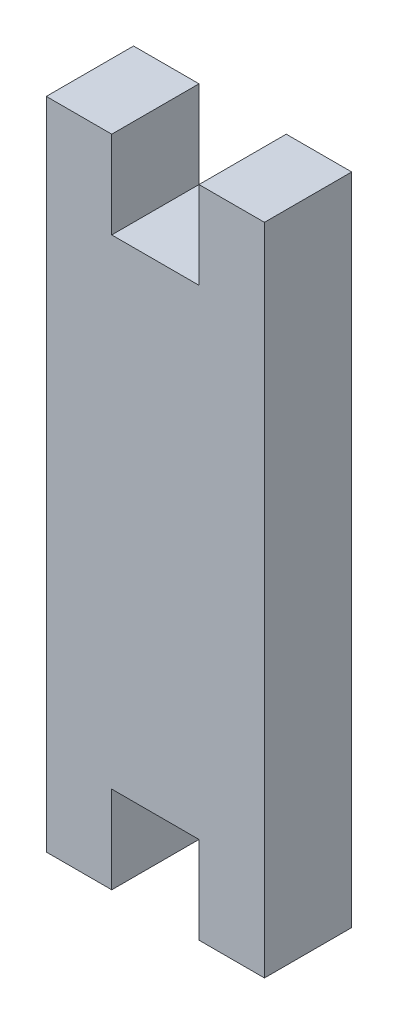
ISO-10303-21;
HEADER;
FILE_DESCRIPTION(('STEP AP214'),'2;1');
FILE_NAME('part.step','',(''),(''),'','','');
FILE_SCHEMA(('AUTOMOTIVE_DESIGN { 1 0 10303 214 1 1 1 1 }'));
ENDSEC;
DATA;
#1=APPLICATION_CONTEXT('core data for automotive mechanical design processes');
#2=APPLICATION_PROTOCOL_DEFINITION('international standard','automotive_design',2000,#1);
#3=PRODUCT_CONTEXT('',#1,'mechanical');
#4=PRODUCT('Part','Part','',(#3));
#5=PRODUCT_RELATED_PRODUCT_CATEGORY('part','',(#4));
#6=PRODUCT_DEFINITION_FORMATION('','',#4);
#7=PRODUCT_DEFINITION_CONTEXT('part definition',#1,'design');
#8=PRODUCT_DEFINITION('design','',#6,#7);
#9=PRODUCT_DEFINITION_SHAPE('','',#8);
#10=(LENGTH_UNIT() NAMED_UNIT(*) SI_UNIT(.MILLI.,.METRE.));
#11=(NAMED_UNIT(*) PLANE_ANGLE_UNIT() SI_UNIT($,.RADIAN.));
#12=(NAMED_UNIT(*) SI_UNIT($,.STERADIAN.) SOLID_ANGLE_UNIT());
#13=UNCERTAINTY_MEASURE_WITH_UNIT(LENGTH_MEASURE(1.E-05),#10,'distance_accuracy_value','');
#14=(GEOMETRIC_REPRESENTATION_CONTEXT(3) GLOBAL_UNCERTAINTY_ASSIGNED_CONTEXT((#13)) GLOBAL_UNIT_ASSIGNED_CONTEXT((#10,
#11,#12)) REPRESENTATION_CONTEXT('',''));
#15=CARTESIAN_POINT('',(0.,0.,0.));
#16=DIRECTION('',(0.,0.,1.));
#17=DIRECTION('',(1.,0.,0.));
#18=AXIS2_PLACEMENT_3D('',#15,#16,#17);
#19=CARTESIAN_POINT('',(0.,30.,4.));
#20=DIRECTION('',(0.,-1.,0.));
#21=DIRECTION('',(0.,0.,-1.));
#22=AXIS2_PLACEMENT_3D('',#19,#20,#21);
#23=PLANE('',#22);
#24=DIRECTION('',(-1.,0.,0.));
#25=VECTOR('',#24,1.);
#26=CARTESIAN_POINT('',(0.,30.,4.));
#27=LINE('',#26,#25);
#28=CARTESIAN_POINT('',(3.,30.,4.));
#29=VERTEX_POINT('',#28);
#30=CARTESIAN_POINT('',(0.,30.,4.));
#31=VERTEX_POINT('',#30);
#32=EDGE_CURVE('E185',#29,#31,#27,.T.);
#33=ORIENTED_EDGE('',*,*,#32,.F.);
#34=DIRECTION('',(0.,0.,-1.));
#35=VECTOR('',#34,1.);
#36=CARTESIAN_POINT('',(3.,30.,4.));
#37=LINE('',#36,#35);
#38=CARTESIAN_POINT('',(3.,30.,0.));
#39=VERTEX_POINT('',#38);
#40=EDGE_CURVE('E150',#29,#39,#37,.T.);
#41=ORIENTED_EDGE('',*,*,#40,.T.);
#42=DIRECTION('',(-1.,0.,0.));
#43=VECTOR('',#42,1.);
#44=CARTESIAN_POINT('',(0.,30.,0.));
#45=LINE('',#44,#43);
#46=CARTESIAN_POINT('',(0.,30.,0.));
#47=VERTEX_POINT('',#46);
#48=EDGE_CURVE('E196',#39,#47,#45,.T.);
#49=ORIENTED_EDGE('',*,*,#48,.T.);
#50=DIRECTION('',(0.,0.,-1.));
#51=VECTOR('',#50,1.);
#52=CARTESIAN_POINT('',(0.,30.,4.));
#53=LINE('',#52,#51);
#54=EDGE_CURVE('E187',#31,#47,#53,.T.);
#55=ORIENTED_EDGE('',*,*,#54,.F.);
#56=EDGE_LOOP('',(#33,#41,#49,#55));
#57=FACE_BOUND('',#56,.T.);
#58=ADVANCED_FACE('F32',(#57),#23,.F.);
#59=CARTESIAN_POINT('',(0.,0.,4.));
#60=DIRECTION('',(0.,1.,0.));
#61=DIRECTION('',(0.,0.,1.));
#62=AXIS2_PLACEMENT_3D('',#59,#60,#61);
#63=PLANE('',#62);
#64=DIRECTION('',(1.,0.,0.));
#65=VECTOR('',#64,1.);
#66=CARTESIAN_POINT('',(0.,0.,0.));
#67=LINE('',#66,#65);
#68=CARTESIAN_POINT('',(0.,0.,0.));
#69=VERTEX_POINT('',#68);
#70=CARTESIAN_POINT('',(3.,0.,0.));
#71=VERTEX_POINT('',#70);
#72=EDGE_CURVE('E191',#69,#71,#67,.T.);
#73=ORIENTED_EDGE('',*,*,#72,.T.);
#74=DIRECTION('',(0.,0.,1.));
#75=VECTOR('',#74,1.);
#76=CARTESIAN_POINT('',(3.,0.,4.));
#77=LINE('',#76,#75);
#78=CARTESIAN_POINT('',(3.,0.,4.));
#79=VERTEX_POINT('',#78);
#80=EDGE_CURVE('E171',#71,#79,#77,.T.);
#81=ORIENTED_EDGE('',*,*,#80,.T.);
#82=DIRECTION('',(1.,0.,0.));
#83=VECTOR('',#82,1.);
#84=CARTESIAN_POINT('',(0.,0.,4.));
#85=LINE('',#84,#83);
#86=CARTESIAN_POINT('',(0.,0.,4.));
#87=VERTEX_POINT('',#86);
#88=EDGE_CURVE('E180',#87,#79,#85,.T.);
#89=ORIENTED_EDGE('',*,*,#88,.F.);
#90=DIRECTION('',(0.,0.,-1.));
#91=VECTOR('',#90,1.);
#92=CARTESIAN_POINT('',(0.,0.,4.));
#93=LINE('',#92,#91);
#94=EDGE_CURVE('E207',#87,#69,#93,.T.);
#95=ORIENTED_EDGE('',*,*,#94,.T.);
#96=EDGE_LOOP('',(#73,#81,#89,#95));
#97=FACE_BOUND('',#96,.T.);
#98=ADVANCED_FACE('F239',(#97),#63,.F.);
#99=CARTESIAN_POINT('',(0.,0.,4.));
#100=DIRECTION('',(1.,0.,0.));
#101=DIRECTION('',(0.,0.,-1.));
#102=AXIS2_PLACEMENT_3D('',#99,#100,#101);
#103=PLANE('',#102);
#104=DIRECTION('',(0.,-1.,0.));
#105=VECTOR('',#104,1.);
#106=CARTESIAN_POINT('',(0.,0.,0.));
#107=LINE('',#106,#105);
#108=EDGE_CURVE('E174',#47,#69,#107,.T.);
#109=ORIENTED_EDGE('',*,*,#108,.T.);
#110=ORIENTED_EDGE('',*,*,#94,.F.);
#111=DIRECTION('',(0.,-1.,0.));
#112=VECTOR('',#111,1.);
#113=CARTESIAN_POINT('',(0.,0.,4.));
#114=LINE('',#113,#112);
#115=EDGE_CURVE('E175',#31,#87,#114,.T.);
#116=ORIENTED_EDGE('',*,*,#115,.F.);
#117=ORIENTED_EDGE('',*,*,#54,.T.);
#118=EDGE_LOOP('',(#109,#110,#116,#117));
#119=FACE_BOUND('',#118,.T.);
#120=ADVANCED_FACE('F34',(#119),#103,.F.);
#121=CARTESIAN_POINT('',(7.,0.,4.));
#122=VERTEX_POINT('',#121);
#123=CARTESIAN_POINT('',(10.,0.,4.));
#124=VERTEX_POINT('',#123);
#125=EDGE_CURVE('E178',#122,#124,#85,.T.);
#126=ORIENTED_EDGE('',*,*,#125,.F.);
#127=DIRECTION('',(0.,0.,-1.));
#128=VECTOR('',#127,1.);
#129=CARTESIAN_POINT('',(7.,0.,4.));
#130=LINE('',#129,#128);
#131=CARTESIAN_POINT('',(7.,0.,0.));
#132=VERTEX_POINT('',#131);
#133=EDGE_CURVE('E167',#122,#132,#130,.T.);
#134=ORIENTED_EDGE('',*,*,#133,.T.);
#135=CARTESIAN_POINT('',(10.,0.,0.));
#136=VERTEX_POINT('',#135);
#137=EDGE_CURVE('E190',#132,#136,#67,.T.);
#138=ORIENTED_EDGE('',*,*,#137,.T.);
#139=DIRECTION('',(0.,0.,-1.));
#140=VECTOR('',#139,1.);
#141=CARTESIAN_POINT('',(10.,0.,4.));
#142=LINE('',#141,#140);
#143=EDGE_CURVE('E204',#124,#136,#142,.T.);
#144=ORIENTED_EDGE('',*,*,#143,.F.);
#145=EDGE_LOOP('',(#126,#134,#138,#144));
#146=FACE_BOUND('',#145,.T.);
#147=ADVANCED_FACE('F217',(#146),#63,.F.);
#148=CARTESIAN_POINT('',(10.,0.,4.));
#149=DIRECTION('',(-1.,0.,0.));
#150=DIRECTION('',(0.,0.,1.));
#151=AXIS2_PLACEMENT_3D('',#148,#149,#150);
#152=PLANE('',#151);
#153=DIRECTION('',(0.,1.,0.));
#154=VECTOR('',#153,1.);
#155=CARTESIAN_POINT('',(10.,0.,0.));
#156=LINE('',#155,#154);
#157=CARTESIAN_POINT('',(10.,30.,0.));
#158=VERTEX_POINT('',#157);
#159=EDGE_CURVE('E194',#136,#158,#156,.T.);
#160=ORIENTED_EDGE('',*,*,#159,.T.);
#161=DIRECTION('',(0.,0.,-1.));
#162=VECTOR('',#161,1.);
#163=CARTESIAN_POINT('',(10.,30.,4.));
#164=LINE('',#163,#162);
#165=CARTESIAN_POINT('',(10.,30.,4.));
#166=VERTEX_POINT('',#165);
#167=EDGE_CURVE('E201',#166,#158,#164,.T.);
#168=ORIENTED_EDGE('',*,*,#167,.F.);
#169=DIRECTION('',(0.,1.,0.));
#170=VECTOR('',#169,1.);
#171=CARTESIAN_POINT('',(10.,0.,4.));
#172=LINE('',#171,#170);
#173=EDGE_CURVE('E183',#124,#166,#172,.T.);
#174=ORIENTED_EDGE('',*,*,#173,.F.);
#175=ORIENTED_EDGE('',*,*,#143,.T.);
#176=EDGE_LOOP('',(#160,#168,#174,#175));
#177=FACE_BOUND('',#176,.T.);
#178=ADVANCED_FACE('F225',(#177),#152,.F.);
#179=CARTESIAN_POINT('',(7.,30.,0.));
#180=VERTEX_POINT('',#179);
#181=EDGE_CURVE('E179',#158,#180,#45,.T.);
#182=ORIENTED_EDGE('',*,*,#181,.T.);
#183=DIRECTION('',(0.,0.,1.));
#184=VECTOR('',#183,1.);
#185=CARTESIAN_POINT('',(7.,30.,4.));
#186=LINE('',#185,#184);
#187=CARTESIAN_POINT('',(7.,30.,4.));
#188=VERTEX_POINT('',#187);
#189=EDGE_CURVE('E46',#180,#188,#186,.T.);
#190=ORIENTED_EDGE('',*,*,#189,.T.);
#191=EDGE_CURVE('E139',#166,#188,#27,.T.);
#192=ORIENTED_EDGE('',*,*,#191,.F.);
#193=ORIENTED_EDGE('',*,*,#167,.T.);
#194=EDGE_LOOP('',(#182,#190,#192,#193));
#195=FACE_BOUND('',#194,.T.);
#196=ADVANCED_FACE('F228',(#195),#23,.F.);
#197=CARTESIAN_POINT('',(0.,30.,4.));
#198=DIRECTION('',(0.,0.,-1.));
#199=DIRECTION('',(-1.,0.,0.));
#200=AXIS2_PLACEMENT_3D('',#197,#198,#199);
#201=PLANE('',#200);
#202=DIRECTION('',(-1.,0.,0.));
#203=VECTOR('',#202,1.);
#204=CARTESIAN_POINT('',(7.,26.,4.));
#205=LINE('',#204,#203);
#206=CARTESIAN_POINT('',(7.,26.,4.));
#207=VERTEX_POINT('',#206);
#208=CARTESIAN_POINT('',(3.,26.,4.));
#209=VERTEX_POINT('',#208);
#210=EDGE_CURVE('E128',#207,#209,#205,.T.);
#211=ORIENTED_EDGE('',*,*,#210,.T.);
#212=DIRECTION('',(0.,1.,0.));
#213=VECTOR('',#212,1.);
#214=CARTESIAN_POINT('',(3.,34.,4.));
#215=LINE('',#214,#213);
#216=EDGE_CURVE('E140',#209,#29,#215,.T.);
#217=ORIENTED_EDGE('',*,*,#216,.T.);
#218=ORIENTED_EDGE('',*,*,#32,.T.);
#219=ORIENTED_EDGE('',*,*,#115,.T.);
#220=ORIENTED_EDGE('',*,*,#88,.T.);
#221=DIRECTION('',(0.,-1.,0.));
#222=VECTOR('',#221,1.);
#223=CARTESIAN_POINT('',(3.,-4.,4.));
#224=LINE('',#223,#222);
#225=CARTESIAN_POINT('',(3.,4.,4.));
#226=VERTEX_POINT('',#225);
#227=EDGE_CURVE('E153',#226,#79,#224,.T.);
#228=ORIENTED_EDGE('',*,*,#227,.F.);
#229=DIRECTION('',(-1.,0.,0.));
#230=VECTOR('',#229,1.);
#231=CARTESIAN_POINT('',(7.,4.,4.));
#232=LINE('',#231,#230);
#233=CARTESIAN_POINT('',(7.,4.,4.));
#234=VERTEX_POINT('',#233);
#235=EDGE_CURVE('E157',#234,#226,#232,.T.);
#236=ORIENTED_EDGE('',*,*,#235,.F.);
#237=DIRECTION('',(0.,1.,0.));
#238=VECTOR('',#237,1.);
#239=CARTESIAN_POINT('',(7.,-4.,4.));
#240=LINE('',#239,#238);
#241=EDGE_CURVE('E161',#122,#234,#240,.T.);
#242=ORIENTED_EDGE('',*,*,#241,.F.);
#243=ORIENTED_EDGE('',*,*,#125,.T.);
#244=ORIENTED_EDGE('',*,*,#173,.T.);
#245=ORIENTED_EDGE('',*,*,#191,.T.);
#246=DIRECTION('',(0.,-1.,0.));
#247=VECTOR('',#246,1.);
#248=CARTESIAN_POINT('',(7.,34.,4.));
#249=LINE('',#248,#247);
#250=EDGE_CURVE('E123',#188,#207,#249,.T.);
#251=ORIENTED_EDGE('',*,*,#250,.T.);
#252=EDGE_LOOP('',(#211,#217,#218,#219,#220,#228,#236,#242,#243,#244,#245,#251));
#253=FACE_BOUND('',#252,.T.);
#254=ADVANCED_FACE('F137',(#253),#201,.F.);
#255=CARTESIAN_POINT('',(0.,30.,0.));
#256=DIRECTION('',(0.,0.,-1.));
#257=DIRECTION('',(-1.,0.,0.));
#258=AXIS2_PLACEMENT_3D('',#255,#256,#257);
#259=PLANE('',#258);
#260=DIRECTION('',(0.,1.,0.));
#261=VECTOR('',#260,1.);
#262=CARTESIAN_POINT('',(3.,34.,0.));
#263=LINE('',#262,#261);
#264=CARTESIAN_POINT('',(3.,26.,0.));
#265=VERTEX_POINT('',#264);
#266=EDGE_CURVE('E145',#265,#39,#263,.T.);
#267=ORIENTED_EDGE('',*,*,#266,.F.);
#268=DIRECTION('',(-1.,0.,0.));
#269=VECTOR('',#268,1.);
#270=CARTESIAN_POINT('',(7.,26.,0.));
#271=LINE('',#270,#269);
#272=CARTESIAN_POINT('',(7.,26.,0.));
#273=VERTEX_POINT('',#272);
#274=EDGE_CURVE('E142',#273,#265,#271,.T.);
#275=ORIENTED_EDGE('',*,*,#274,.F.);
#276=DIRECTION('',(0.,-1.,0.));
#277=VECTOR('',#276,1.);
#278=CARTESIAN_POINT('',(7.,30.,0.));
#279=LINE('',#278,#277);
#280=EDGE_CURVE('E11',#180,#273,#279,.T.);
#281=ORIENTED_EDGE('',*,*,#280,.F.);
#282=ORIENTED_EDGE('',*,*,#181,.F.);
#283=ORIENTED_EDGE('',*,*,#159,.F.);
#284=ORIENTED_EDGE('',*,*,#137,.F.);
#285=DIRECTION('',(0.,-1.,0.));
#286=VECTOR('',#285,1.);
#287=CARTESIAN_POINT('',(7.00000000000001,30.,0.));
#288=LINE('',#287,#286);
#289=CARTESIAN_POINT('',(7.,4.,0.));
#290=VERTEX_POINT('',#289);
#291=EDGE_CURVE('E40',#290,#132,#288,.T.);
#292=ORIENTED_EDGE('',*,*,#291,.F.);
#293=DIRECTION('',(-1.,0.,0.));
#294=VECTOR('',#293,1.);
#295=CARTESIAN_POINT('',(7.,4.,0.));
#296=LINE('',#295,#294);
#297=CARTESIAN_POINT('',(3.,4.,0.));
#298=VERTEX_POINT('',#297);
#299=EDGE_CURVE('E54',#290,#298,#296,.T.);
#300=ORIENTED_EDGE('',*,*,#299,.T.);
#301=DIRECTION('',(0.,-1.,0.));
#302=VECTOR('',#301,1.);
#303=CARTESIAN_POINT('',(3.,-4.,0.));
#304=LINE('',#303,#302);
#305=EDGE_CURVE('E154',#298,#71,#304,.T.);
#306=ORIENTED_EDGE('',*,*,#305,.T.);
#307=ORIENTED_EDGE('',*,*,#72,.F.);
#308=ORIENTED_EDGE('',*,*,#108,.F.);
#309=ORIENTED_EDGE('',*,*,#48,.F.);
#310=EDGE_LOOP('',(#267,#275,#281,#282,#283,#284,#292,#300,#306,#307,#308,#309));
#311=FACE_BOUND('',#310,.T.);
#312=ADVANCED_FACE('F221',(#311),#259,.T.);
#313=CARTESIAN_POINT('',(3.,-4.,0.));
#314=DIRECTION('',(-1.,0.,0.));
#315=DIRECTION('',(0.,0.,1.));
#316=AXIS2_PLACEMENT_3D('',#313,#314,#315);
#317=PLANE('',#316);
#318=ORIENTED_EDGE('',*,*,#305,.F.);
#319=DIRECTION('',(0.,0.,1.));
#320=VECTOR('',#319,1.);
#321=CARTESIAN_POINT('',(3.,4.,0.));
#322=LINE('',#321,#320);
#323=EDGE_CURVE('E165',#298,#226,#322,.T.);
#324=ORIENTED_EDGE('',*,*,#323,.T.);
#325=ORIENTED_EDGE('',*,*,#227,.T.);
#326=ORIENTED_EDGE('',*,*,#80,.F.);
#327=EDGE_LOOP('',(#318,#324,#325,#326));
#328=FACE_BOUND('',#327,.T.);
#329=ADVANCED_FACE('F259',(#328),#317,.F.);
#330=CARTESIAN_POINT('',(7.,-4.,0.));
#331=DIRECTION('',(1.,0.,0.));
#332=DIRECTION('',(0.,1.,0.));
#333=AXIS2_PLACEMENT_3D('',#330,#331,#332);
#334=PLANE('',#333);
#335=ORIENTED_EDGE('',*,*,#241,.T.);
#336=DIRECTION('',(0.,0.,1.));
#337=VECTOR('',#336,1.);
#338=CARTESIAN_POINT('',(7.,4.,0.));
#339=LINE('',#338,#337);
#340=EDGE_CURVE('E159',#290,#234,#339,.T.);
#341=ORIENTED_EDGE('',*,*,#340,.F.);
#342=ORIENTED_EDGE('',*,*,#291,.T.);
#343=ORIENTED_EDGE('',*,*,#133,.F.);
#344=EDGE_LOOP('',(#335,#341,#342,#343));
#345=FACE_BOUND('',#344,.T.);
#346=ADVANCED_FACE('F211',(#345),#334,.F.);
#347=CARTESIAN_POINT('',(7.,4.,0.));
#348=DIRECTION('',(0.,1.,0.));
#349=DIRECTION('',(0.,0.,1.));
#350=AXIS2_PLACEMENT_3D('',#347,#348,#349);
#351=PLANE('',#350);
#352=ORIENTED_EDGE('',*,*,#235,.T.);
#353=ORIENTED_EDGE('',*,*,#323,.F.);
#354=ORIENTED_EDGE('',*,*,#299,.F.);
#355=ORIENTED_EDGE('',*,*,#340,.T.);
#356=EDGE_LOOP('',(#352,#353,#354,#355));
#357=FACE_BOUND('',#356,.T.);
#358=ADVANCED_FACE('F260',(#357),#351,.F.);
#359=CARTESIAN_POINT('',(3.,34.,4.));
#360=DIRECTION('',(-1.,0.,0.));
#361=DIRECTION('',(0.,0.,1.));
#362=AXIS2_PLACEMENT_3D('',#359,#360,#361);
#363=PLANE('',#362);
#364=ORIENTED_EDGE('',*,*,#216,.F.);
#365=DIRECTION('',(0.,0.,-1.));
#366=VECTOR('',#365,1.);
#367=CARTESIAN_POINT('',(3.,26.,4.));
#368=LINE('',#367,#366);
#369=EDGE_CURVE('E127',#209,#265,#368,.T.);
#370=ORIENTED_EDGE('',*,*,#369,.T.);
#371=ORIENTED_EDGE('',*,*,#266,.T.);
#372=ORIENTED_EDGE('',*,*,#40,.F.);
#373=EDGE_LOOP('',(#364,#370,#371,#372));
#374=FACE_BOUND('',#373,.T.);
#375=ADVANCED_FACE('F252',(#374),#363,.F.);
#376=CARTESIAN_POINT('',(7.,34.,4.));
#377=DIRECTION('',(1.,0.,0.));
#378=DIRECTION('',(0.,1.,0.));
#379=AXIS2_PLACEMENT_3D('',#376,#377,#378);
#380=PLANE('',#379);
#381=ORIENTED_EDGE('',*,*,#280,.T.);
#382=DIRECTION('',(0.,0.,-1.));
#383=VECTOR('',#382,1.);
#384=CARTESIAN_POINT('',(7.,26.,4.));
#385=LINE('',#384,#383);
#386=EDGE_CURVE('E119',#207,#273,#385,.T.);
#387=ORIENTED_EDGE('',*,*,#386,.F.);
#388=ORIENTED_EDGE('',*,*,#250,.F.);
#389=ORIENTED_EDGE('',*,*,#189,.F.);
#390=EDGE_LOOP('',(#381,#387,#388,#389));
#391=FACE_BOUND('',#390,.T.);
#392=ADVANCED_FACE('F121',(#391),#380,.F.);
#393=CARTESIAN_POINT('',(7.,26.,4.));
#394=DIRECTION('',(0.,-1.,0.));
#395=DIRECTION('',(1.,0.,0.));
#396=AXIS2_PLACEMENT_3D('',#393,#394,#395);
#397=PLANE('',#396);
#398=ORIENTED_EDGE('',*,*,#274,.T.);
#399=ORIENTED_EDGE('',*,*,#369,.F.);
#400=ORIENTED_EDGE('',*,*,#210,.F.);
#401=ORIENTED_EDGE('',*,*,#386,.T.);
#402=EDGE_LOOP('',(#398,#399,#400,#401));
#403=FACE_BOUND('',#402,.T.);
#404=ADVANCED_FACE('F131',(#403),#397,.F.);
#405=CLOSED_SHELL('',(#58,#98,#120,#147,#178,#196,#254,#312,#329,#346,#358,#375,#392,#404));
#406=MANIFOLD_SOLID_BREP('B2',#405);
#407=ADVANCED_BREP_SHAPE_REPRESENTATION('',(#18,#406),#14);
#408=SHAPE_DEFINITION_REPRESENTATION(#9,#407);
ENDSEC;
END-ISO-10303-21;
